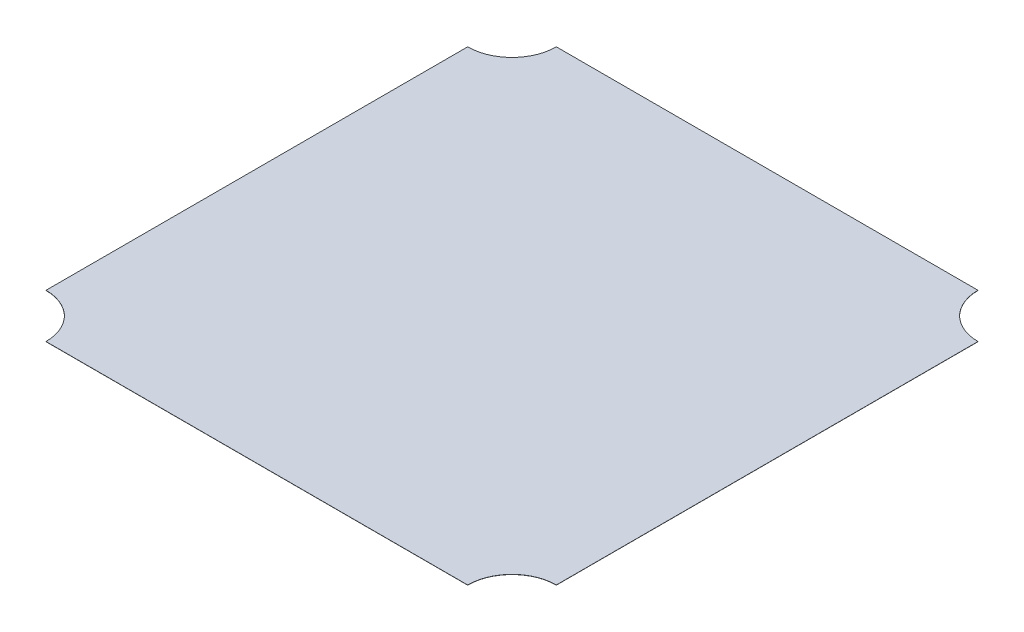
ISO-10303-21;
HEADER;
FILE_DESCRIPTION(('STEP AP214'),'2;1');
FILE_NAME('part.step','',(''),(''),'','','');
FILE_SCHEMA(('AUTOMOTIVE_DESIGN { 1 0 10303 214 1 1 1 1 }'));
ENDSEC;
DATA;
#1=APPLICATION_CONTEXT('core data for automotive mechanical design processes');
#2=APPLICATION_PROTOCOL_DEFINITION('international standard','automotive_design',2000,#1);
#3=PRODUCT_CONTEXT('',#1,'mechanical');
#4=PRODUCT('Part','Part','',(#3));
#5=PRODUCT_RELATED_PRODUCT_CATEGORY('part','',(#4));
#6=PRODUCT_DEFINITION_FORMATION('','',#4);
#7=PRODUCT_DEFINITION_CONTEXT('part definition',#1,'design');
#8=PRODUCT_DEFINITION('design','',#6,#7);
#9=PRODUCT_DEFINITION_SHAPE('','',#8);
#10=(LENGTH_UNIT() NAMED_UNIT(*) SI_UNIT(.MILLI.,.METRE.));
#11=(NAMED_UNIT(*) PLANE_ANGLE_UNIT() SI_UNIT($,.RADIAN.));
#12=(NAMED_UNIT(*) SI_UNIT($,.STERADIAN.) SOLID_ANGLE_UNIT());
#13=UNCERTAINTY_MEASURE_WITH_UNIT(LENGTH_MEASURE(1.E-05),#10,'distance_accuracy_value','');
#14=(GEOMETRIC_REPRESENTATION_CONTEXT(3) GLOBAL_UNCERTAINTY_ASSIGNED_CONTEXT((#13)) GLOBAL_UNIT_ASSIGNED_CONTEXT((#10,
#11,#12)) REPRESENTATION_CONTEXT('',''));
#15=CARTESIAN_POINT('',(0.,0.,0.));
#16=DIRECTION('',(0.,0.,1.));
#17=DIRECTION('',(1.,0.,0.));
#18=AXIS2_PLACEMENT_3D('',#15,#16,#17);
#19=CARTESIAN_POINT('',(-76.2,0.0254,76.2));
#20=DIRECTION('',(1.,0.,0.));
#21=DIRECTION('',(0.,0.,-1.));
#22=AXIS2_PLACEMENT_3D('',#19,#20,#21);
#23=PLANE('',#22);
#24=DIRECTION('',(0.,0.,-1.));
#25=VECTOR('',#24,1.);
#26=CARTESIAN_POINT('',(-76.2,-0.0254,76.2));
#27=LINE('',#26,#25);
#28=CARTESIAN_POINT('',(-76.2,-0.0253999999999983,57.15));
#29=VERTEX_POINT('',#28);
#30=CARTESIAN_POINT('',(-76.2,-0.0253999999999983,-63.5));
#31=VERTEX_POINT('',#30);
#32=EDGE_CURVE('E149',#29,#31,#27,.T.);
#33=ORIENTED_EDGE('',*,*,#32,.F.);
#34=DIRECTION('',(0.,1.,0.));
#35=VECTOR('',#34,1.);
#36=CARTESIAN_POINT('',(-76.2,-25.3746,57.15));
#37=LINE('',#36,#35);
#38=CARTESIAN_POINT('',(-76.2,0.0253999999999983,57.15));
#39=VERTEX_POINT('',#38);
#40=EDGE_CURVE('E152',#29,#39,#37,.T.);
#41=ORIENTED_EDGE('',*,*,#40,.T.);
#42=DIRECTION('',(0.,0.,-1.));
#43=VECTOR('',#42,1.);
#44=CARTESIAN_POINT('',(-76.2,0.0254,76.2));
#45=LINE('',#44,#43);
#46=CARTESIAN_POINT('',(-76.2,0.0253999999999983,-63.5));
#47=VERTEX_POINT('',#46);
#48=EDGE_CURVE('E151',#39,#47,#45,.T.);
#49=ORIENTED_EDGE('',*,*,#48,.T.);
#50=DIRECTION('',(0.,1.,0.));
#51=VECTOR('',#50,1.);
#52=CARTESIAN_POINT('',(-76.2,-25.3746,-63.5));
#53=LINE('',#52,#51);
#54=EDGE_CURVE('E137',#31,#47,#53,.T.);
#55=ORIENTED_EDGE('',*,*,#54,.F.);
#56=EDGE_LOOP('',(#33,#41,#49,#55));
#57=FACE_BOUND('',#56,.T.);
#58=ADVANCED_FACE('F71',(#57),#23,.F.);
#59=CARTESIAN_POINT('',(76.2,-0.0254,76.2));
#60=DIRECTION('',(0.,1.,0.));
#61=DIRECTION('',(0.,0.,1.));
#62=AXIS2_PLACEMENT_3D('',#59,#60,#61);
#63=PLANE('',#62);
#64=DIRECTION('',(1.,0.,0.));
#65=VECTOR('',#64,1.);
#66=CARTESIAN_POINT('',(76.2,-0.0254,69.85));
#67=LINE('',#66,#65);
#68=CARTESIAN_POINT('',(-63.5,-0.0253999999999983,69.85));
#69=VERTEX_POINT('',#68);
#70=CARTESIAN_POINT('',(57.15,-0.0253999999999983,69.85));
#71=VERTEX_POINT('',#70);
#72=EDGE_CURVE('E199',#69,#71,#67,.T.);
#73=ORIENTED_EDGE('',*,*,#72,.F.);
#74=CARTESIAN_POINT('',(-76.2,-0.0253999999999983,69.85));
#75=DIRECTION('',(0.,1.,0.));
#76=DIRECTION('',(0.,0.,1.));
#77=AXIS2_PLACEMENT_3D('',#74,#75,#76);
#78=CIRCLE('',#77,12.7);
#79=EDGE_CURVE('E157',#69,#29,#78,.T.);
#80=ORIENTED_EDGE('',*,*,#79,.T.);
#81=ORIENTED_EDGE('',*,*,#32,.T.);
#82=CARTESIAN_POINT('',(-76.2,-0.0253999999999983,-76.2));
#83=DIRECTION('',(0.,1.,0.));
#84=DIRECTION('',(0.,0.,1.));
#85=AXIS2_PLACEMENT_3D('',#82,#83,#84);
#86=CIRCLE('',#85,12.7);
#87=CARTESIAN_POINT('',(-63.5,-0.0253999999999983,-76.2));
#88=VERTEX_POINT('',#87);
#89=EDGE_CURVE('E134',#31,#88,#86,.T.);
#90=ORIENTED_EDGE('',*,*,#89,.T.);
#91=DIRECTION('',(1.,0.,0.));
#92=VECTOR('',#91,1.);
#93=CARTESIAN_POINT('',(76.2,-0.0254,-76.2));
#94=LINE('',#93,#92);
#95=CARTESIAN_POINT('',(57.15,-0.0254,-76.2));
#96=VERTEX_POINT('',#95);
#97=EDGE_CURVE('E202',#88,#96,#94,.T.);
#98=ORIENTED_EDGE('',*,*,#97,.T.);
#99=CARTESIAN_POINT('',(69.85,-0.0253999999999983,-76.2));
#100=DIRECTION('',(0.,1.,0.));
#101=DIRECTION('',(0.,0.,1.));
#102=AXIS2_PLACEMENT_3D('',#99,#100,#101);
#103=CIRCLE('',#102,12.7);
#104=CARTESIAN_POINT('',(69.85,-0.0253999999999983,-63.5));
#105=VERTEX_POINT('',#104);
#106=EDGE_CURVE('E85',#96,#105,#103,.T.);
#107=ORIENTED_EDGE('',*,*,#106,.T.);
#108=DIRECTION('',(0.,0.,1.));
#109=VECTOR('',#108,1.);
#110=CARTESIAN_POINT('',(69.85,-0.0254,76.2));
#111=LINE('',#110,#109);
#112=CARTESIAN_POINT('',(69.85,-0.0253999999999983,57.15));
#113=VERTEX_POINT('',#112);
#114=EDGE_CURVE('E193',#105,#113,#111,.T.);
#115=ORIENTED_EDGE('',*,*,#114,.T.);
#116=CARTESIAN_POINT('',(69.85,-0.0253999999999983,69.85));
#117=DIRECTION('',(0.,1.,0.));
#118=DIRECTION('',(0.,0.,1.));
#119=AXIS2_PLACEMENT_3D('',#116,#117,#118);
#120=CIRCLE('',#119,12.7);
#121=EDGE_CURVE('E196',#113,#71,#120,.T.);
#122=ORIENTED_EDGE('',*,*,#121,.T.);
#123=EDGE_LOOP('',(#73,#80,#81,#90,#98,#107,#115,#122));
#124=FACE_BOUND('',#123,.T.);
#125=ADVANCED_FACE('F156',(#124),#63,.F.);
#126=CARTESIAN_POINT('',(76.2,0.0254,76.2));
#127=DIRECTION('',(0.,-1.,0.));
#128=DIRECTION('',(0.,0.,-1.));
#129=AXIS2_PLACEMENT_3D('',#126,#127,#128);
#130=PLANE('',#129);
#131=ORIENTED_EDGE('',*,*,#48,.F.);
#132=CARTESIAN_POINT('',(-76.2,0.0253999999999983,69.85));
#133=DIRECTION('',(0.,-1.,0.));
#134=DIRECTION('',(0.,0.,-1.));
#135=AXIS2_PLACEMENT_3D('',#132,#133,#134);
#136=CIRCLE('',#135,12.7);
#137=CARTESIAN_POINT('',(-63.5,0.0253999999999983,69.85));
#138=VERTEX_POINT('',#137);
#139=EDGE_CURVE('E12',#39,#138,#136,.T.);
#140=ORIENTED_EDGE('',*,*,#139,.T.);
#141=DIRECTION('',(-1.,0.,0.));
#142=VECTOR('',#141,1.);
#143=CARTESIAN_POINT('',(76.2,0.0254,69.85));
#144=LINE('',#143,#142);
#145=CARTESIAN_POINT('',(57.15,0.0253999999999983,69.85));
#146=VERTEX_POINT('',#145);
#147=EDGE_CURVE('E78',#146,#138,#144,.T.);
#148=ORIENTED_EDGE('',*,*,#147,.F.);
#149=CARTESIAN_POINT('',(69.85,0.0253999999999983,69.85));
#150=DIRECTION('',(0.,-1.,0.));
#151=DIRECTION('',(0.,0.,-1.));
#152=AXIS2_PLACEMENT_3D('',#149,#150,#151);
#153=CIRCLE('',#152,12.7);
#154=CARTESIAN_POINT('',(69.85,0.0253999999999983,57.15));
#155=VERTEX_POINT('',#154);
#156=EDGE_CURVE('E169',#146,#155,#153,.T.);
#157=ORIENTED_EDGE('',*,*,#156,.T.);
#158=DIRECTION('',(0.,0.,-1.));
#159=VECTOR('',#158,1.);
#160=CARTESIAN_POINT('',(69.85,0.0254,76.2));
#161=LINE('',#160,#159);
#162=CARTESIAN_POINT('',(69.85,0.0253999999999983,-63.5));
#163=VERTEX_POINT('',#162);
#164=EDGE_CURVE('E166',#155,#163,#161,.T.);
#165=ORIENTED_EDGE('',*,*,#164,.T.);
#166=CARTESIAN_POINT('',(69.85,0.0253999999999983,-76.2));
#167=DIRECTION('',(0.,-1.,0.));
#168=DIRECTION('',(0.,0.,-1.));
#169=AXIS2_PLACEMENT_3D('',#166,#167,#168);
#170=CIRCLE('',#169,12.7);
#171=CARTESIAN_POINT('',(57.15,0.0253999999999983,-76.2));
#172=VERTEX_POINT('',#171);
#173=EDGE_CURVE('E143',#163,#172,#170,.T.);
#174=ORIENTED_EDGE('',*,*,#173,.T.);
#175=DIRECTION('',(-1.,0.,0.));
#176=VECTOR('',#175,1.);
#177=CARTESIAN_POINT('',(76.2,0.0254,-76.2));
#178=LINE('',#177,#176);
#179=CARTESIAN_POINT('',(-63.5,0.0254,-76.2));
#180=VERTEX_POINT('',#179);
#181=EDGE_CURVE('E161',#172,#180,#178,.T.);
#182=ORIENTED_EDGE('',*,*,#181,.T.);
#183=CARTESIAN_POINT('',(-76.2,0.0253999999999983,-76.2));
#184=DIRECTION('',(0.,-1.,0.));
#185=DIRECTION('',(0.,0.,-1.));
#186=AXIS2_PLACEMENT_3D('',#183,#184,#185);
#187=CIRCLE('',#186,12.7);
#188=EDGE_CURVE('E93',#180,#47,#187,.T.);
#189=ORIENTED_EDGE('',*,*,#188,.T.);
#190=EDGE_LOOP('',(#131,#140,#148,#157,#165,#174,#182,#189));
#191=FACE_BOUND('',#190,.T.);
#192=ADVANCED_FACE('F184',(#191),#130,.F.);
#193=CARTESIAN_POINT('',(0.,0.,-76.2));
#194=DIRECTION('',(0.,0.,-1.));
#195=DIRECTION('',(-1.,0.,0.));
#196=AXIS2_PLACEMENT_3D('',#193,#194,#195);
#197=PLANE('',#196);
#198=DIRECTION('',(0.,1.,0.));
#199=VECTOR('',#198,1.);
#200=CARTESIAN_POINT('',(57.15,-25.3746,-76.2));
#201=LINE('',#200,#199);
#202=EDGE_CURVE('E159',#96,#172,#201,.T.);
#203=ORIENTED_EDGE('',*,*,#202,.F.);
#204=ORIENTED_EDGE('',*,*,#97,.F.);
#205=DIRECTION('',(0.,1.,0.));
#206=VECTOR('',#205,1.);
#207=CARTESIAN_POINT('',(-63.5,-25.3746,-76.2));
#208=LINE('',#207,#206);
#209=EDGE_CURVE('E138',#180,#88,#208,.F.);
#210=ORIENTED_EDGE('',*,*,#209,.F.);
#211=ORIENTED_EDGE('',*,*,#181,.F.);
#212=EDGE_LOOP('',(#203,#204,#210,#211));
#213=FACE_BOUND('',#212,.T.);
#214=ADVANCED_FACE('F204',(#213),#197,.T.);
#215=CARTESIAN_POINT('',(-76.2,-25.3746,-76.2));
#216=DIRECTION('',(0.,1.,0.));
#217=DIRECTION('',(0.,0.,1.));
#218=AXIS2_PLACEMENT_3D('',#215,#216,#217);
#219=CYLINDRICAL_SURFACE('',#218,12.7);
#220=ORIENTED_EDGE('',*,*,#54,.T.);
#221=ORIENTED_EDGE('',*,*,#188,.F.);
#222=ORIENTED_EDGE('',*,*,#209,.T.);
#223=ORIENTED_EDGE('',*,*,#89,.F.);
#224=EDGE_LOOP('',(#220,#221,#222,#223));
#225=FACE_BOUND('',#224,.T.);
#226=ADVANCED_FACE('F136',(#225),#219,.F.);
#227=CARTESIAN_POINT('',(-76.2,-25.3746,69.85));
#228=DIRECTION('',(0.,1.,0.));
#229=DIRECTION('',(0.,0.,1.));
#230=AXIS2_PLACEMENT_3D('',#227,#228,#229);
#231=CYLINDRICAL_SURFACE('',#230,12.7);
#232=DIRECTION('',(0.,1.,0.));
#233=VECTOR('',#232,1.);
#234=CARTESIAN_POINT('',(-63.5,-25.3746,69.85));
#235=LINE('',#234,#233);
#236=EDGE_CURVE('E177',#69,#138,#235,.T.);
#237=ORIENTED_EDGE('',*,*,#236,.T.);
#238=ORIENTED_EDGE('',*,*,#139,.F.);
#239=ORIENTED_EDGE('',*,*,#40,.F.);
#240=ORIENTED_EDGE('',*,*,#79,.F.);
#241=EDGE_LOOP('',(#237,#238,#239,#240));
#242=FACE_BOUND('',#241,.T.);
#243=ADVANCED_FACE('F182',(#242),#231,.F.);
#244=CARTESIAN_POINT('',(0.,-25.3746,69.85));
#245=DIRECTION('',(0.,0.,1.));
#246=DIRECTION('',(1.,0.,0.));
#247=AXIS2_PLACEMENT_3D('',#244,#245,#246);
#248=PLANE('',#247);
#249=ORIENTED_EDGE('',*,*,#72,.T.);
#250=DIRECTION('',(0.,1.,0.));
#251=VECTOR('',#250,1.);
#252=CARTESIAN_POINT('',(57.15,-25.3746,69.85));
#253=LINE('',#252,#251);
#254=EDGE_CURVE('E179',#71,#146,#253,.T.);
#255=ORIENTED_EDGE('',*,*,#254,.T.);
#256=ORIENTED_EDGE('',*,*,#147,.T.);
#257=ORIENTED_EDGE('',*,*,#236,.F.);
#258=EDGE_LOOP('',(#249,#255,#256,#257));
#259=FACE_BOUND('',#258,.T.);
#260=ADVANCED_FACE('F176',(#259),#248,.T.);
#261=CARTESIAN_POINT('',(69.85,-25.3746,69.85));
#262=DIRECTION('',(0.,1.,0.));
#263=DIRECTION('',(0.,0.,1.));
#264=AXIS2_PLACEMENT_3D('',#261,#262,#263);
#265=CYLINDRICAL_SURFACE('',#264,12.7);
#266=DIRECTION('',(0.,1.,0.));
#267=VECTOR('',#266,1.);
#268=CARTESIAN_POINT('',(69.85,-25.3746,57.15));
#269=LINE('',#268,#267);
#270=EDGE_CURVE('E211',#113,#155,#269,.T.);
#271=ORIENTED_EDGE('',*,*,#270,.T.);
#272=ORIENTED_EDGE('',*,*,#156,.F.);
#273=ORIENTED_EDGE('',*,*,#254,.F.);
#274=ORIENTED_EDGE('',*,*,#121,.F.);
#275=EDGE_LOOP('',(#271,#272,#273,#274));
#276=FACE_BOUND('',#275,.T.);
#277=ADVANCED_FACE('F214',(#276),#265,.F.);
#278=CARTESIAN_POINT('',(69.85,-25.3746,0.));
#279=DIRECTION('',(-1.,0.,0.));
#280=DIRECTION('',(0.,0.,1.));
#281=AXIS2_PLACEMENT_3D('',#278,#279,#280);
#282=PLANE('',#281);
#283=DIRECTION('',(0.,1.,0.));
#284=VECTOR('',#283,1.);
#285=CARTESIAN_POINT('',(69.85,-25.3746,-63.5));
#286=LINE('',#285,#284);
#287=EDGE_CURVE('E212',#105,#163,#286,.T.);
#288=ORIENTED_EDGE('',*,*,#287,.T.);
#289=ORIENTED_EDGE('',*,*,#164,.F.);
#290=ORIENTED_EDGE('',*,*,#270,.F.);
#291=ORIENTED_EDGE('',*,*,#114,.F.);
#292=EDGE_LOOP('',(#288,#289,#290,#291));
#293=FACE_BOUND('',#292,.T.);
#294=ADVANCED_FACE('F210',(#293),#282,.F.);
#295=CARTESIAN_POINT('',(69.85,-25.3746,-76.2));
#296=DIRECTION('',(0.,1.,0.));
#297=DIRECTION('',(0.,0.,1.));
#298=AXIS2_PLACEMENT_3D('',#295,#296,#297);
#299=CYLINDRICAL_SURFACE('',#298,12.7);
#300=ORIENTED_EDGE('',*,*,#202,.T.);
#301=ORIENTED_EDGE('',*,*,#173,.F.);
#302=ORIENTED_EDGE('',*,*,#287,.F.);
#303=ORIENTED_EDGE('',*,*,#106,.F.);
#304=EDGE_LOOP('',(#300,#301,#302,#303));
#305=FACE_BOUND('',#304,.T.);
#306=ADVANCED_FACE('F205',(#305),#299,.F.);
#307=CLOSED_SHELL('',(#58,#125,#192,#214,#226,#243,#260,#277,#294,#306));
#308=MANIFOLD_SOLID_BREP('B2',#307);
#309=ADVANCED_BREP_SHAPE_REPRESENTATION('',(#18,#308),#14);
#310=SHAPE_DEFINITION_REPRESENTATION(#9,#309);
ENDSEC;
END-ISO-10303-21;
